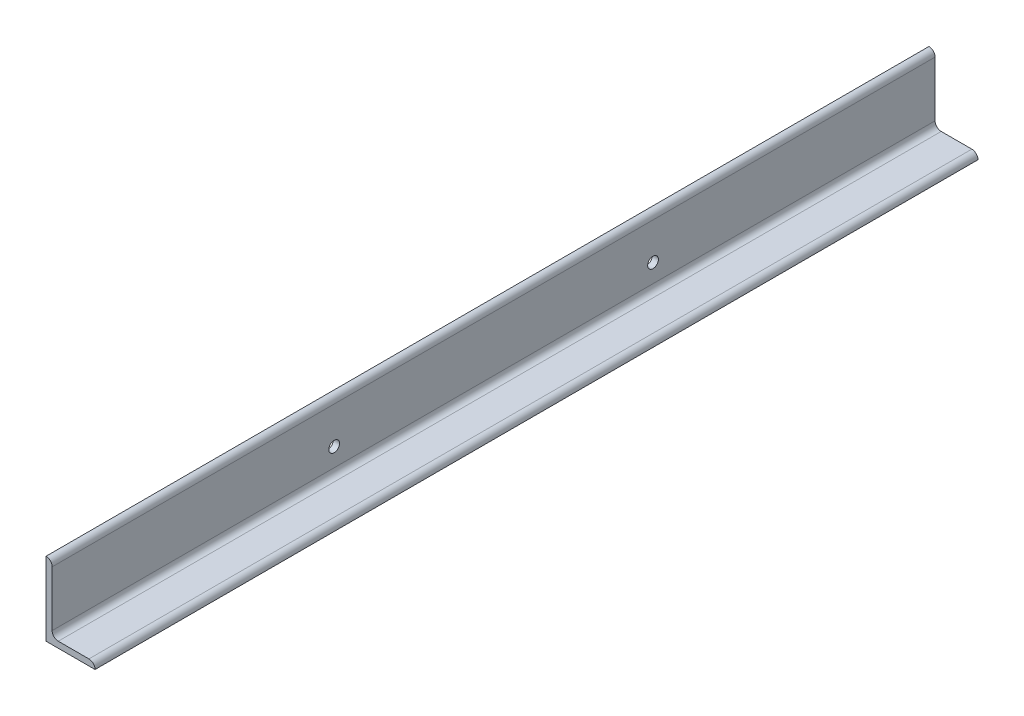
ISO-10303-21;
HEADER;
FILE_DESCRIPTION(('STEP AP214'),'2;1');
FILE_NAME('part.step','',(''),(''),'','','');
FILE_SCHEMA(('AUTOMOTIVE_DESIGN { 1 0 10303 214 1 1 1 1 }'));
ENDSEC;
DATA;
#1=APPLICATION_CONTEXT('core data for automotive mechanical design processes');
#2=APPLICATION_PROTOCOL_DEFINITION('international standard','automotive_design',2000,#1);
#3=PRODUCT_CONTEXT('',#1,'mechanical');
#4=PRODUCT('Part','Part','',(#3));
#5=PRODUCT_RELATED_PRODUCT_CATEGORY('part','',(#4));
#6=PRODUCT_DEFINITION_FORMATION('','',#4);
#7=PRODUCT_DEFINITION_CONTEXT('part definition',#1,'design');
#8=PRODUCT_DEFINITION('design','',#6,#7);
#9=PRODUCT_DEFINITION_SHAPE('','',#8);
#10=(LENGTH_UNIT() NAMED_UNIT(*) SI_UNIT(.MILLI.,.METRE.));
#11=(NAMED_UNIT(*) PLANE_ANGLE_UNIT() SI_UNIT($,.RADIAN.));
#12=(NAMED_UNIT(*) SI_UNIT($,.STERADIAN.) SOLID_ANGLE_UNIT());
#13=UNCERTAINTY_MEASURE_WITH_UNIT(LENGTH_MEASURE(1.E-05),#10,'distance_accuracy_value','');
#14=(GEOMETRIC_REPRESENTATION_CONTEXT(3) GLOBAL_UNCERTAINTY_ASSIGNED_CONTEXT((#13)) GLOBAL_UNIT_ASSIGNED_CONTEXT((#10,
#11,#12)) REPRESENTATION_CONTEXT('',''));
#15=CARTESIAN_POINT('',(0.,0.,0.));
#16=DIRECTION('',(0.,0.,1.));
#17=DIRECTION('',(1.,0.,0.));
#18=AXIS2_PLACEMENT_3D('',#15,#16,#17);
#19=CARTESIAN_POINT('',(101.6,0.,914.4));
#20=DIRECTION('',(0.,1.,0.));
#21=DIRECTION('',(-1.,0.,0.));
#22=AXIS2_PLACEMENT_3D('',#19,#20,#21);
#23=PLANE('',#22);
#24=DIRECTION('',(1.,0.,0.));
#25=VECTOR('',#24,1.);
#26=CARTESIAN_POINT('',(101.6,0.,-914.4));
#27=LINE('',#26,#25);
#28=CARTESIAN_POINT('',(0.,0.,-914.4));
#29=VERTEX_POINT('',#28);
#30=CARTESIAN_POINT('',(101.6,0.,-914.4));
#31=VERTEX_POINT('',#30);
#32=EDGE_CURVE('E119',#29,#31,#27,.T.);
#33=ORIENTED_EDGE('',*,*,#32,.T.);
#34=DIRECTION('',(0.,0.,-1.));
#35=VECTOR('',#34,1.);
#36=CARTESIAN_POINT('',(101.6,0.,914.4));
#37=LINE('',#36,#35);
#38=CARTESIAN_POINT('',(101.6,0.,914.4));
#39=VERTEX_POINT('',#38);
#40=EDGE_CURVE('E11',#39,#31,#37,.T.);
#41=ORIENTED_EDGE('',*,*,#40,.F.);
#42=DIRECTION('',(1.,0.,0.));
#43=VECTOR('',#42,1.);
#44=CARTESIAN_POINT('',(101.6,0.,914.4));
#45=LINE('',#44,#43);
#46=CARTESIAN_POINT('',(0.,0.,914.4));
#47=VERTEX_POINT('',#46);
#48=EDGE_CURVE('E136',#47,#39,#45,.T.);
#49=ORIENTED_EDGE('',*,*,#48,.F.);
#50=DIRECTION('',(0.,0.,-1.));
#51=VECTOR('',#50,1.);
#52=CARTESIAN_POINT('',(0.,0.,914.4));
#53=LINE('',#52,#51);
#54=EDGE_CURVE('E115',#47,#29,#53,.T.);
#55=ORIENTED_EDGE('',*,*,#54,.T.);
#56=EDGE_LOOP('',(#33,#41,#49,#55));
#57=FACE_BOUND('',#56,.T.);
#58=ADVANCED_FACE('F17',(#57),#23,.F.);
#59=CARTESIAN_POINT('',(101.6,0.00508000000000622,914.4));
#60=DIRECTION('',(-1.,0.,0.));
#61=DIRECTION('',(0.,0.,1.));
#62=AXIS2_PLACEMENT_3D('',#59,#60,#61);
#63=PLANE('',#62);
#64=DIRECTION('',(0.,1.,0.));
#65=VECTOR('',#64,1.);
#66=CARTESIAN_POINT('',(101.6,0.00508000000000622,-914.4));
#67=LINE('',#66,#65);
#68=CARTESIAN_POINT('',(101.6,0.00508000000000622,-914.4));
#69=VERTEX_POINT('',#68);
#70=EDGE_CURVE('E122',#31,#69,#67,.T.);
#71=ORIENTED_EDGE('',*,*,#70,.T.);
#72=DIRECTION('',(0.,0.,-1.));
#73=VECTOR('',#72,1.);
#74=CARTESIAN_POINT('',(101.6,0.00508000000000622,914.4));
#75=LINE('',#74,#73);
#76=CARTESIAN_POINT('',(101.6,0.00508000000000622,914.4));
#77=VERTEX_POINT('',#76);
#78=EDGE_CURVE('E25',#77,#69,#75,.T.);
#79=ORIENTED_EDGE('',*,*,#78,.F.);
#80=DIRECTION('',(0.,1.,0.));
#81=VECTOR('',#80,1.);
#82=CARTESIAN_POINT('',(101.6,0.00508000000000622,914.4));
#83=LINE('',#82,#81);
#84=EDGE_CURVE('E79',#39,#77,#83,.T.);
#85=ORIENTED_EDGE('',*,*,#84,.F.);
#86=ORIENTED_EDGE('',*,*,#40,.T.);
#87=EDGE_LOOP('',(#71,#79,#85,#86));
#88=FACE_BOUND('',#87,.T.);
#89=ADVANCED_FACE('F212',(#88),#63,.F.);
#90=CARTESIAN_POINT('',(88.90508,0.00508000000000467,914.4));
#91=DIRECTION('',(0.,0.,-1.));
#92=DIRECTION('',(-1.,0.,0.));
#93=AXIS2_PLACEMENT_3D('',#90,#91,#92);
#94=CYLINDRICAL_SURFACE('',#93,12.69492);
#95=CARTESIAN_POINT('',(88.90508,0.00508000000000467,-914.4));
#96=DIRECTION('',(0.,0.,1.));
#97=DIRECTION('',(1.,0.,0.));
#98=AXIS2_PLACEMENT_3D('',#95,#96,#97);
#99=CIRCLE('',#98,12.69492);
#100=CARTESIAN_POINT('',(88.90508,12.7,-914.4));
#101=VERTEX_POINT('',#100);
#102=EDGE_CURVE('E125',#69,#101,#99,.T.);
#103=ORIENTED_EDGE('',*,*,#102,.T.);
#104=DIRECTION('',(0.,0.,-1.));
#105=VECTOR('',#104,1.);
#106=CARTESIAN_POINT('',(88.90508,12.7,914.4));
#107=LINE('',#106,#105);
#108=CARTESIAN_POINT('',(88.90508,12.7,914.4));
#109=VERTEX_POINT('',#108);
#110=EDGE_CURVE('E146',#109,#101,#107,.T.);
#111=ORIENTED_EDGE('',*,*,#110,.F.);
#112=CARTESIAN_POINT('',(88.90508,0.00508000000000467,914.4));
#113=DIRECTION('',(0.,0.,1.));
#114=DIRECTION('',(1.,0.,0.));
#115=AXIS2_PLACEMENT_3D('',#112,#113,#114);
#116=CIRCLE('',#115,12.69492);
#117=EDGE_CURVE('E154',#77,#109,#116,.T.);
#118=ORIENTED_EDGE('',*,*,#117,.F.);
#119=ORIENTED_EDGE('',*,*,#78,.T.);
#120=EDGE_LOOP('',(#103,#111,#118,#119));
#121=FACE_BOUND('',#120,.T.);
#122=ADVANCED_FACE('F152',(#121),#94,.T.);
#123=CARTESIAN_POINT('',(25.4,12.7,914.4));
#124=DIRECTION('',(0.,-1.,0.));
#125=DIRECTION('',(0.,0.,-1.));
#126=AXIS2_PLACEMENT_3D('',#123,#124,#125);
#127=PLANE('',#126);
#128=DIRECTION('',(-1.,0.,0.));
#129=VECTOR('',#128,1.);
#130=CARTESIAN_POINT('',(25.4,12.7,-914.4));
#131=LINE('',#130,#129);
#132=CARTESIAN_POINT('',(25.4,12.7,-914.4));
#133=VERTEX_POINT('',#132);
#134=EDGE_CURVE('E127',#101,#133,#131,.T.);
#135=ORIENTED_EDGE('',*,*,#134,.T.);
#136=DIRECTION('',(0.,0.,-1.));
#137=VECTOR('',#136,1.);
#138=CARTESIAN_POINT('',(25.4,12.7,914.4));
#139=LINE('',#138,#137);
#140=CARTESIAN_POINT('',(25.4,12.7,914.4));
#141=VERTEX_POINT('',#140);
#142=EDGE_CURVE('E143',#141,#133,#139,.T.);
#143=ORIENTED_EDGE('',*,*,#142,.F.);
#144=DIRECTION('',(-1.,0.,0.));
#145=VECTOR('',#144,1.);
#146=CARTESIAN_POINT('',(25.4,12.7,914.4));
#147=LINE('',#146,#145);
#148=EDGE_CURVE('E170',#109,#141,#147,.T.);
#149=ORIENTED_EDGE('',*,*,#148,.F.);
#150=ORIENTED_EDGE('',*,*,#110,.T.);
#151=EDGE_LOOP('',(#135,#143,#149,#150));
#152=FACE_BOUND('',#151,.T.);
#153=ADVANCED_FACE('F163',(#152),#127,.F.);
#154=CARTESIAN_POINT('',(25.4,25.4,914.4));
#155=DIRECTION('',(0.,0.,-1.));
#156=DIRECTION('',(-1.,0.,0.));
#157=AXIS2_PLACEMENT_3D('',#154,#155,#156);
#158=CYLINDRICAL_SURFACE('',#157,12.7);
#159=CARTESIAN_POINT('',(25.4,25.4,-914.4));
#160=DIRECTION('',(0.,0.,-1.));
#161=DIRECTION('',(-1.,0.,0.));
#162=AXIS2_PLACEMENT_3D('',#159,#160,#161);
#163=CIRCLE('',#162,12.7);
#164=CARTESIAN_POINT('',(12.7,25.4,-914.4));
#165=VERTEX_POINT('',#164);
#166=EDGE_CURVE('E129',#133,#165,#163,.T.);
#167=ORIENTED_EDGE('',*,*,#166,.T.);
#168=DIRECTION('',(0.,0.,-1.));
#169=VECTOR('',#168,1.);
#170=CARTESIAN_POINT('',(12.7,25.4,914.4));
#171=LINE('',#170,#169);
#172=CARTESIAN_POINT('',(12.7,25.4,914.4));
#173=VERTEX_POINT('',#172);
#174=EDGE_CURVE('E140',#173,#165,#171,.T.);
#175=ORIENTED_EDGE('',*,*,#174,.F.);
#176=CARTESIAN_POINT('',(25.4,25.4,914.4));
#177=DIRECTION('',(0.,0.,-1.));
#178=DIRECTION('',(-1.,0.,0.));
#179=AXIS2_PLACEMENT_3D('',#176,#177,#178);
#180=CIRCLE('',#179,12.7);
#181=EDGE_CURVE('E169',#141,#173,#180,.T.);
#182=ORIENTED_EDGE('',*,*,#181,.F.);
#183=ORIENTED_EDGE('',*,*,#142,.T.);
#184=EDGE_LOOP('',(#167,#175,#182,#183));
#185=FACE_BOUND('',#184,.T.);
#186=ADVANCED_FACE('F167',(#185),#158,.F.);
#187=CARTESIAN_POINT('',(12.7,139.70508,914.4));
#188=DIRECTION('',(-1.,0.,0.));
#189=DIRECTION('',(0.,-1.,0.));
#190=AXIS2_PLACEMENT_3D('',#187,#188,#189);
#191=PLANE('',#190);
#192=CARTESIAN_POINT('',(12.7,63.5,-330.2));
#193=DIRECTION('',(-1.,0.,0.));
#194=DIRECTION('',(0.,-1.,0.));
#195=AXIS2_PLACEMENT_3D('',#192,#193,#194);
#196=CIRCLE('',#195,11.1125);
#197=CARTESIAN_POINT('',(12.7,52.3875,-330.2));
#198=VERTEX_POINT('',#197);
#199=EDGE_CURVE('E182',#198,#198,#196,.F.);
#200=ORIENTED_EDGE('',*,*,#199,.F.);
#201=EDGE_LOOP('',(#200));
#202=FACE_BOUND('',#201,.T.);
#203=CARTESIAN_POINT('',(12.7,63.5,330.2));
#204=DIRECTION('',(-1.,0.,0.));
#205=DIRECTION('',(0.,-1.,0.));
#206=AXIS2_PLACEMENT_3D('',#203,#204,#205);
#207=CIRCLE('',#206,11.1125);
#208=CARTESIAN_POINT('',(12.7,52.3875,330.2));
#209=VERTEX_POINT('',#208);
#210=EDGE_CURVE('E123',#209,#209,#207,.F.);
#211=ORIENTED_EDGE('',*,*,#210,.F.);
#212=EDGE_LOOP('',(#211));
#213=FACE_BOUND('',#212,.T.);
#214=DIRECTION('',(0.,1.,0.));
#215=VECTOR('',#214,1.);
#216=CARTESIAN_POINT('',(12.7,139.70508,-914.4));
#217=LINE('',#216,#215);
#218=CARTESIAN_POINT('',(12.7,139.70508,-914.4));
#219=VERTEX_POINT('',#218);
#220=EDGE_CURVE('E131',#165,#219,#217,.T.);
#221=ORIENTED_EDGE('',*,*,#220,.T.);
#222=DIRECTION('',(0.,0.,-1.));
#223=VECTOR('',#222,1.);
#224=CARTESIAN_POINT('',(12.7,139.70508,914.4));
#225=LINE('',#224,#223);
#226=CARTESIAN_POINT('',(12.7,139.70508,914.4));
#227=VERTEX_POINT('',#226);
#228=EDGE_CURVE('E110',#227,#219,#225,.T.);
#229=ORIENTED_EDGE('',*,*,#228,.F.);
#230=DIRECTION('',(0.,1.,0.));
#231=VECTOR('',#230,1.);
#232=CARTESIAN_POINT('',(12.7,139.70508,914.4));
#233=LINE('',#232,#231);
#234=EDGE_CURVE('E101',#173,#227,#233,.T.);
#235=ORIENTED_EDGE('',*,*,#234,.F.);
#236=ORIENTED_EDGE('',*,*,#174,.T.);
#237=EDGE_LOOP('',(#221,#229,#235,#236));
#238=FACE_BOUND('',#237,.T.);
#239=ADVANCED_FACE('F204',(#202,#213,#238),#191,.F.);
#240=CARTESIAN_POINT('',(0.00508000000000078,139.70508,914.4));
#241=DIRECTION('',(0.,0.,-1.));
#242=DIRECTION('',(-1.,0.,0.));
#243=AXIS2_PLACEMENT_3D('',#240,#241,#242);
#244=CYLINDRICAL_SURFACE('',#243,12.69492);
#245=CARTESIAN_POINT('',(0.00508000000000078,139.70508,-914.4));
#246=DIRECTION('',(0.,0.,1.));
#247=DIRECTION('',(-1.,0.,0.));
#248=AXIS2_PLACEMENT_3D('',#245,#246,#247);
#249=CIRCLE('',#248,12.69492);
#250=CARTESIAN_POINT('',(0.00508,152.4,-914.4));
#251=VERTEX_POINT('',#250);
#252=EDGE_CURVE('E109',#219,#251,#249,.T.);
#253=ORIENTED_EDGE('',*,*,#252,.T.);
#254=DIRECTION('',(0.,0.,-1.));
#255=VECTOR('',#254,1.);
#256=CARTESIAN_POINT('',(0.00508,152.4,914.4));
#257=LINE('',#256,#255);
#258=CARTESIAN_POINT('',(0.00508,152.4,914.4));
#259=VERTEX_POINT('',#258);
#260=EDGE_CURVE('E106',#259,#251,#257,.T.);
#261=ORIENTED_EDGE('',*,*,#260,.F.);
#262=CARTESIAN_POINT('',(0.00508000000000078,139.70508,914.4));
#263=DIRECTION('',(0.,0.,1.));
#264=DIRECTION('',(-1.,0.,0.));
#265=AXIS2_PLACEMENT_3D('',#262,#263,#264);
#266=CIRCLE('',#265,12.69492);
#267=EDGE_CURVE('E95',#227,#259,#266,.T.);
#268=ORIENTED_EDGE('',*,*,#267,.F.);
#269=ORIENTED_EDGE('',*,*,#228,.T.);
#270=EDGE_LOOP('',(#253,#261,#268,#269));
#271=FACE_BOUND('',#270,.T.);
#272=ADVANCED_FACE('F107',(#271),#244,.T.);
#273=CARTESIAN_POINT('',(0.,152.4,914.4));
#274=DIRECTION('',(0.,-1.,0.));
#275=DIRECTION('',(0.,0.,-1.));
#276=AXIS2_PLACEMENT_3D('',#273,#274,#275);
#277=PLANE('',#276);
#278=DIRECTION('',(-1.,0.,0.));
#279=VECTOR('',#278,1.);
#280=CARTESIAN_POINT('',(0.,152.4,-914.4));
#281=LINE('',#280,#279);
#282=CARTESIAN_POINT('',(0.,152.4,-914.4));
#283=VERTEX_POINT('',#282);
#284=EDGE_CURVE('E65',#251,#283,#281,.T.);
#285=ORIENTED_EDGE('',*,*,#284,.T.);
#286=DIRECTION('',(0.,0.,-1.));
#287=VECTOR('',#286,1.);
#288=CARTESIAN_POINT('',(0.,152.4,914.4));
#289=LINE('',#288,#287);
#290=CARTESIAN_POINT('',(0.,152.4,914.4));
#291=VERTEX_POINT('',#290);
#292=EDGE_CURVE('E111',#291,#283,#289,.T.);
#293=ORIENTED_EDGE('',*,*,#292,.F.);
#294=DIRECTION('',(-1.,0.,0.));
#295=VECTOR('',#294,1.);
#296=CARTESIAN_POINT('',(0.,152.4,914.4));
#297=LINE('',#296,#295);
#298=EDGE_CURVE('E99',#259,#291,#297,.T.);
#299=ORIENTED_EDGE('',*,*,#298,.F.);
#300=ORIENTED_EDGE('',*,*,#260,.T.);
#301=EDGE_LOOP('',(#285,#293,#299,#300));
#302=FACE_BOUND('',#301,.T.);
#303=ADVANCED_FACE('F113',(#302),#277,.F.);
#304=CARTESIAN_POINT('',(0.,0.,914.4));
#305=DIRECTION('',(1.,0.,0.));
#306=DIRECTION('',(0.,0.,-1.));
#307=AXIS2_PLACEMENT_3D('',#304,#305,#306);
#308=PLANE('',#307);
#309=CARTESIAN_POINT('',(0.,63.5,-330.2));
#310=DIRECTION('',(-1.,0.,0.));
#311=DIRECTION('',(0.,0.,1.));
#312=AXIS2_PLACEMENT_3D('',#309,#310,#311);
#313=CIRCLE('',#312,11.1125);
#314=CARTESIAN_POINT('',(0.,63.5,-319.0875));
#315=VERTEX_POINT('',#314);
#316=EDGE_CURVE('E185',#315,#315,#313,.T.);
#317=ORIENTED_EDGE('',*,*,#316,.F.);
#318=EDGE_LOOP('',(#317));
#319=FACE_BOUND('',#318,.T.);
#320=CARTESIAN_POINT('',(0.,63.5,330.2));
#321=DIRECTION('',(-1.,0.,0.));
#322=DIRECTION('',(0.,0.,1.));
#323=AXIS2_PLACEMENT_3D('',#320,#321,#322);
#324=CIRCLE('',#323,11.1125);
#325=CARTESIAN_POINT('',(0.,63.5,341.3125));
#326=VERTEX_POINT('',#325);
#327=EDGE_CURVE('E179',#326,#326,#324,.T.);
#328=ORIENTED_EDGE('',*,*,#327,.F.);
#329=EDGE_LOOP('',(#328));
#330=FACE_BOUND('',#329,.T.);
#331=DIRECTION('',(0.,-1.,0.));
#332=VECTOR('',#331,1.);
#333=CARTESIAN_POINT('',(0.,0.,-914.4));
#334=LINE('',#333,#332);
#335=EDGE_CURVE('E71',#283,#29,#334,.T.);
#336=ORIENTED_EDGE('',*,*,#335,.T.);
#337=ORIENTED_EDGE('',*,*,#54,.F.);
#338=DIRECTION('',(0.,-1.,0.));
#339=VECTOR('',#338,1.);
#340=CARTESIAN_POINT('',(0.,0.,914.4));
#341=LINE('',#340,#339);
#342=EDGE_CURVE('E33',#291,#47,#341,.T.);
#343=ORIENTED_EDGE('',*,*,#342,.F.);
#344=ORIENTED_EDGE('',*,*,#292,.T.);
#345=EDGE_LOOP('',(#336,#337,#343,#344));
#346=FACE_BOUND('',#345,.T.);
#347=ADVANCED_FACE('F192',(#319,#330,#346),#308,.F.);
#348=CARTESIAN_POINT('',(0.00508000000000078,139.70508,914.4));
#349=DIRECTION('',(0.,0.,-1.));
#350=DIRECTION('',(-1.,0.,0.));
#351=AXIS2_PLACEMENT_3D('',#348,#349,#350);
#352=PLANE('',#351);
#353=ORIENTED_EDGE('',*,*,#48,.T.);
#354=ORIENTED_EDGE('',*,*,#84,.T.);
#355=ORIENTED_EDGE('',*,*,#117,.T.);
#356=ORIENTED_EDGE('',*,*,#148,.T.);
#357=ORIENTED_EDGE('',*,*,#181,.T.);
#358=ORIENTED_EDGE('',*,*,#234,.T.);
#359=ORIENTED_EDGE('',*,*,#267,.T.);
#360=ORIENTED_EDGE('',*,*,#298,.T.);
#361=ORIENTED_EDGE('',*,*,#342,.T.);
#362=EDGE_LOOP('',(#353,#354,#355,#356,#357,#358,#359,#360,#361));
#363=FACE_BOUND('',#362,.T.);
#364=ADVANCED_FACE('F97',(#363),#352,.F.);
#365=CARTESIAN_POINT('',(0.00508000000000078,139.70508,-914.4));
#366=DIRECTION('',(0.,0.,-1.));
#367=DIRECTION('',(-1.,0.,0.));
#368=AXIS2_PLACEMENT_3D('',#365,#366,#367);
#369=PLANE('',#368);
#370=ORIENTED_EDGE('',*,*,#32,.F.);
#371=ORIENTED_EDGE('',*,*,#335,.F.);
#372=ORIENTED_EDGE('',*,*,#284,.F.);
#373=ORIENTED_EDGE('',*,*,#252,.F.);
#374=ORIENTED_EDGE('',*,*,#220,.F.);
#375=ORIENTED_EDGE('',*,*,#166,.F.);
#376=ORIENTED_EDGE('',*,*,#134,.F.);
#377=ORIENTED_EDGE('',*,*,#102,.F.);
#378=ORIENTED_EDGE('',*,*,#70,.F.);
#379=EDGE_LOOP('',(#370,#371,#372,#373,#374,#375,#376,#377,#378));
#380=FACE_BOUND('',#379,.T.);
#381=ADVANCED_FACE('F158',(#380),#369,.T.);
#382=CARTESIAN_POINT('',(101.601,63.5,330.2));
#383=DIRECTION('',(-1.,0.,0.));
#384=DIRECTION('',(0.,0.,1.));
#385=AXIS2_PLACEMENT_3D('',#382,#383,#384);
#386=CYLINDRICAL_SURFACE('',#385,11.1125);
#387=ORIENTED_EDGE('',*,*,#327,.T.);
#388=EDGE_LOOP('',(#387));
#389=FACE_BOUND('',#388,.T.);
#390=ORIENTED_EDGE('',*,*,#210,.T.);
#391=EDGE_LOOP('',(#390));
#392=FACE_BOUND('',#391,.T.);
#393=ADVANCED_FACE('F198',(#389,#392),#386,.F.);
#394=CARTESIAN_POINT('',(101.601,63.5,-330.2));
#395=DIRECTION('',(-1.,0.,0.));
#396=DIRECTION('',(0.,0.,1.));
#397=AXIS2_PLACEMENT_3D('',#394,#395,#396);
#398=CYLINDRICAL_SURFACE('',#397,11.1125);
#399=ORIENTED_EDGE('',*,*,#316,.T.);
#400=EDGE_LOOP('',(#399));
#401=FACE_BOUND('',#400,.T.);
#402=ORIENTED_EDGE('',*,*,#199,.T.);
#403=EDGE_LOOP('',(#402));
#404=FACE_BOUND('',#403,.T.);
#405=ADVANCED_FACE('F189',(#401,#404),#398,.F.);
#406=CLOSED_SHELL('',(#58,#89,#122,#153,#186,#239,#272,#303,#347,#364,#381,#393,#405));
#407=MANIFOLD_SOLID_BREP('B1',#406);
#408=ADVANCED_BREP_SHAPE_REPRESENTATION('',(#18,#407),#14);
#409=SHAPE_DEFINITION_REPRESENTATION(#9,#408);
ENDSEC;
END-ISO-10303-21;
